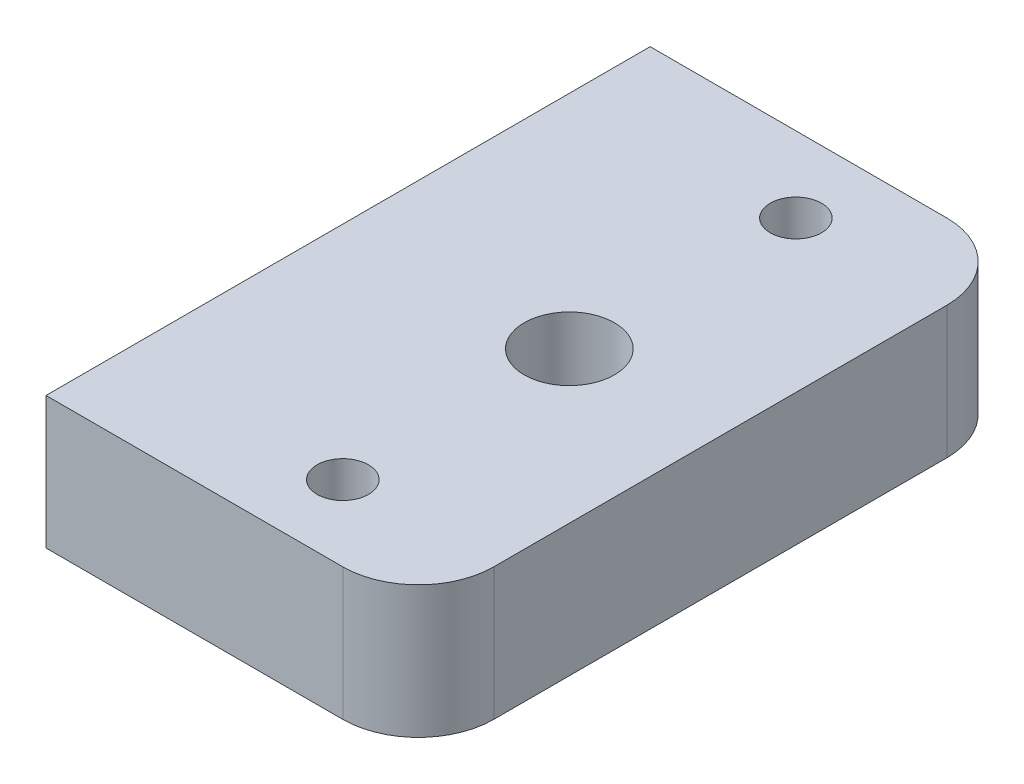
ISO-10303-21;
HEADER;
FILE_DESCRIPTION(('STEP AP214'),'2;1');
FILE_NAME('part.step','',(''),(''),'','','');
FILE_SCHEMA(('AUTOMOTIVE_DESIGN { 1 0 10303 214 1 1 1 1 }'));
ENDSEC;
DATA;
#1=APPLICATION_CONTEXT('core data for automotive mechanical design processes');
#2=APPLICATION_PROTOCOL_DEFINITION('international standard','automotive_design',2000,#1);
#3=PRODUCT_CONTEXT('',#1,'mechanical');
#4=PRODUCT('Part','Part','',(#3));
#5=PRODUCT_RELATED_PRODUCT_CATEGORY('part','',(#4));
#6=PRODUCT_DEFINITION_FORMATION('','',#4);
#7=PRODUCT_DEFINITION_CONTEXT('part definition',#1,'design');
#8=PRODUCT_DEFINITION('design','',#6,#7);
#9=PRODUCT_DEFINITION_SHAPE('','',#8);
#10=(LENGTH_UNIT() NAMED_UNIT(*) SI_UNIT(.MILLI.,.METRE.));
#11=(NAMED_UNIT(*) PLANE_ANGLE_UNIT() SI_UNIT($,.RADIAN.));
#12=(NAMED_UNIT(*) SI_UNIT($,.STERADIAN.) SOLID_ANGLE_UNIT());
#13=UNCERTAINTY_MEASURE_WITH_UNIT(LENGTH_MEASURE(1.E-05),#10,'distance_accuracy_value','');
#14=(GEOMETRIC_REPRESENTATION_CONTEXT(3) GLOBAL_UNCERTAINTY_ASSIGNED_CONTEXT((#13)) GLOBAL_UNIT_ASSIGNED_CONTEXT((#10,
#11,#12)) REPRESENTATION_CONTEXT('',''));
#15=CARTESIAN_POINT('',(0.,0.,0.));
#16=DIRECTION('',(0.,0.,1.));
#17=DIRECTION('',(1.,0.,0.));
#18=AXIS2_PLACEMENT_3D('',#15,#16,#17);
#19=CARTESIAN_POINT('',(-9.30275,5.55625,-12.7));
#20=DIRECTION('',(0.,1.,0.));
#21=DIRECTION('',(0.,0.,1.));
#22=AXIS2_PLACEMENT_3D('',#19,#20,#21);
#23=PLANE('',#22);
#24=CARTESIAN_POINT('',(0.,5.55625,-9.525));
#25=DIRECTION('',(0.,1.,0.));
#26=DIRECTION('',(0.,0.,1.));
#27=AXIS2_PLACEMENT_3D('',#24,#25,#26);
#28=CIRCLE('',#27,1.0795);
#29=CARTESIAN_POINT('',(0.,5.55625,-8.4455));
#30=VERTEX_POINT('',#29);
#31=EDGE_CURVE('E547',#30,#30,#28,.T.);
#32=ORIENTED_EDGE('',*,*,#31,.F.);
#33=EDGE_LOOP('',(#32));
#34=FACE_BOUND('',#33,.T.);
#35=DIRECTION('',(1.,0.,0.));
#36=VECTOR('',#35,1.);
#37=CARTESIAN_POINT('',(6.35,5.55625,12.7));
#38=LINE('',#37,#36);
#39=CARTESIAN_POINT('',(-9.30275,5.55625,12.7));
#40=VERTEX_POINT('',#39);
#41=CARTESIAN_POINT('',(3.175,5.55625,12.7));
#42=VERTEX_POINT('',#41);
#43=EDGE_CURVE('E456',#40,#42,#38,.T.);
#44=ORIENTED_EDGE('',*,*,#43,.T.);
#45=CARTESIAN_POINT('',(3.175,5.55625,9.525));
#46=DIRECTION('',(0.,1.,0.));
#47=DIRECTION('',(0.,0.,1.));
#48=AXIS2_PLACEMENT_3D('',#45,#46,#47);
#49=CIRCLE('',#48,3.175);
#50=CARTESIAN_POINT('',(6.35,5.55625,9.525));
#51=VERTEX_POINT('',#50);
#52=EDGE_CURVE('E368',#42,#51,#49,.T.);
#53=ORIENTED_EDGE('',*,*,#52,.T.);
#54=DIRECTION('',(0.,0.,-1.));
#55=VECTOR('',#54,1.);
#56=CARTESIAN_POINT('',(6.35,5.55625,-12.7));
#57=LINE('',#56,#55);
#58=CARTESIAN_POINT('',(6.35,5.55625,-9.525));
#59=VERTEX_POINT('',#58);
#60=EDGE_CURVE('E442',#51,#59,#57,.T.);
#61=ORIENTED_EDGE('',*,*,#60,.T.);
#62=CARTESIAN_POINT('',(3.175,5.55625,-9.525));
#63=DIRECTION('',(0.,1.,0.));
#64=DIRECTION('',(0.,0.,1.));
#65=AXIS2_PLACEMENT_3D('',#62,#63,#64);
#66=CIRCLE('',#65,3.175);
#67=CARTESIAN_POINT('',(3.175,5.55625,-12.7));
#68=VERTEX_POINT('',#67);
#69=EDGE_CURVE('E375',#59,#68,#66,.T.);
#70=ORIENTED_EDGE('',*,*,#69,.T.);
#71=DIRECTION('',(-1.,0.,0.));
#72=VECTOR('',#71,1.);
#73=CARTESIAN_POINT('',(6.35,5.55625,-12.7));
#74=LINE('',#73,#72);
#75=CARTESIAN_POINT('',(-9.30275,5.55625,-12.7));
#76=VERTEX_POINT('',#75);
#77=EDGE_CURVE('E467',#68,#76,#74,.T.);
#78=ORIENTED_EDGE('',*,*,#77,.T.);
#79=DIRECTION('',(0.,0.,1.));
#80=VECTOR('',#79,1.);
#81=CARTESIAN_POINT('',(-9.30275,5.55625,-12.7));
#82=LINE('',#81,#80);
#83=EDGE_CURVE('E436',#76,#40,#82,.T.);
#84=ORIENTED_EDGE('',*,*,#83,.T.);
#85=EDGE_LOOP('',(#44,#53,#61,#70,#78,#84));
#86=FACE_BOUND('',#85,.T.);
#87=CARTESIAN_POINT('',(0.,5.55625,0.));
#88=DIRECTION('',(0.,1.,0.));
#89=DIRECTION('',(0.,0.,1.));
#90=AXIS2_PLACEMENT_3D('',#87,#88,#89);
#91=CIRCLE('',#90,1.89865);
#92=CARTESIAN_POINT('',(0.,5.55625,1.89865));
#93=VERTEX_POINT('',#92);
#94=EDGE_CURVE('E423',#93,#93,#91,.T.);
#95=ORIENTED_EDGE('',*,*,#94,.F.);
#96=EDGE_LOOP('',(#95));
#97=FACE_BOUND('',#96,.T.);
#98=CARTESIAN_POINT('',(0.,5.55625,9.525));
#99=DIRECTION('',(0.,1.,0.));
#100=DIRECTION('',(0.,0.,1.));
#101=AXIS2_PLACEMENT_3D('',#98,#99,#100);
#102=CIRCLE('',#101,1.0795);
#103=CARTESIAN_POINT('',(0.,5.55625,10.6045));
#104=VERTEX_POINT('',#103);
#105=EDGE_CURVE('E556',#104,#104,#102,.T.);
#106=ORIENTED_EDGE('',*,*,#105,.F.);
#107=EDGE_LOOP('',(#106));
#108=FACE_BOUND('',#107,.T.);
#109=ADVANCED_FACE('F360',(#34,#86,#97,#108),#23,.T.);
#110=CARTESIAN_POINT('',(-9.30275,0.,-12.7));
#111=DIRECTION('',(0.,1.,0.));
#112=DIRECTION('',(0.,0.,1.));
#113=AXIS2_PLACEMENT_3D('',#110,#111,#112);
#114=PLANE('',#113);
#115=CARTESIAN_POINT('',(0.,0.,-9.525));
#116=DIRECTION('',(0.,1.,0.));
#117=DIRECTION('',(0.,0.,1.));
#118=AXIS2_PLACEMENT_3D('',#115,#116,#117);
#119=CIRCLE('',#118,1.0795);
#120=CARTESIAN_POINT('',(0.,0.,-8.4455));
#121=VERTEX_POINT('',#120);
#122=EDGE_CURVE('E551',#121,#121,#119,.T.);
#123=ORIENTED_EDGE('',*,*,#122,.T.);
#124=EDGE_LOOP('',(#123));
#125=FACE_BOUND('',#124,.T.);
#126=DIRECTION('',(0.,0.,-1.));
#127=VECTOR('',#126,1.);
#128=CARTESIAN_POINT('',(6.35,0.,-12.7));
#129=LINE('',#128,#127);
#130=CARTESIAN_POINT('',(6.35,0.,9.525));
#131=VERTEX_POINT('',#130);
#132=CARTESIAN_POINT('',(6.35,0.,-9.525));
#133=VERTEX_POINT('',#132);
#134=EDGE_CURVE('E464',#131,#133,#129,.T.);
#135=ORIENTED_EDGE('',*,*,#134,.F.);
#136=CARTESIAN_POINT('',(3.175,0.,9.525));
#137=DIRECTION('',(0.,1.,0.));
#138=DIRECTION('',(0.,0.,1.));
#139=AXIS2_PLACEMENT_3D('',#136,#137,#138);
#140=CIRCLE('',#139,3.175);
#141=CARTESIAN_POINT('',(3.175,0.,12.7));
#142=VERTEX_POINT('',#141);
#143=EDGE_CURVE('E450',#131,#142,#140,.F.);
#144=ORIENTED_EDGE('',*,*,#143,.T.);
#145=DIRECTION('',(1.,0.,0.));
#146=VECTOR('',#145,1.);
#147=CARTESIAN_POINT('',(6.35,0.,12.7));
#148=LINE('',#147,#146);
#149=CARTESIAN_POINT('',(-9.30275,0.,12.7));
#150=VERTEX_POINT('',#149);
#151=EDGE_CURVE('E429',#150,#142,#148,.T.);
#152=ORIENTED_EDGE('',*,*,#151,.F.);
#153=DIRECTION('',(0.,0.,1.));
#154=VECTOR('',#153,1.);
#155=CARTESIAN_POINT('',(-9.30275,0.,-12.7));
#156=LINE('',#155,#154);
#157=CARTESIAN_POINT('',(-9.30275,0.,-12.7));
#158=VERTEX_POINT('',#157);
#159=EDGE_CURVE('E422',#158,#150,#156,.T.);
#160=ORIENTED_EDGE('',*,*,#159,.F.);
#161=DIRECTION('',(-1.,0.,0.));
#162=VECTOR('',#161,1.);
#163=CARTESIAN_POINT('',(6.35,0.,-12.7));
#164=LINE('',#163,#162);
#165=CARTESIAN_POINT('',(3.175,0.,-12.7));
#166=VERTEX_POINT('',#165);
#167=EDGE_CURVE('E416',#166,#158,#164,.T.);
#168=ORIENTED_EDGE('',*,*,#167,.F.);
#169=CARTESIAN_POINT('',(3.175,0.,-9.525));
#170=DIRECTION('',(0.,1.,0.));
#171=DIRECTION('',(0.,0.,1.));
#172=AXIS2_PLACEMENT_3D('',#169,#170,#171);
#173=CIRCLE('',#172,3.175);
#174=EDGE_CURVE('E448',#166,#133,#173,.F.);
#175=ORIENTED_EDGE('',*,*,#174,.T.);
#176=EDGE_LOOP('',(#135,#144,#152,#160,#168,#175));
#177=FACE_BOUND('',#176,.T.);
#178=CARTESIAN_POINT('',(0.,0.,0.));
#179=DIRECTION('',(0.,1.,0.));
#180=DIRECTION('',(0.,0.,1.));
#181=AXIS2_PLACEMENT_3D('',#178,#179,#180);
#182=CIRCLE('',#181,1.89865);
#183=CARTESIAN_POINT('',(0.,0.,1.89865));
#184=VERTEX_POINT('',#183);
#185=EDGE_CURVE('E546',#184,#184,#182,.T.);
#186=ORIENTED_EDGE('',*,*,#185,.T.);
#187=EDGE_LOOP('',(#186));
#188=FACE_BOUND('',#187,.T.);
#189=CARTESIAN_POINT('',(0.,0.,9.525));
#190=DIRECTION('',(0.,1.,0.));
#191=DIRECTION('',(0.,0.,1.));
#192=AXIS2_PLACEMENT_3D('',#189,#190,#191);
#193=CIRCLE('',#192,1.0795);
#194=CARTESIAN_POINT('',(0.,0.,10.6045));
#195=VERTEX_POINT('',#194);
#196=EDGE_CURVE('E559',#195,#195,#193,.T.);
#197=ORIENTED_EDGE('',*,*,#196,.T.);
#198=EDGE_LOOP('',(#197));
#199=FACE_BOUND('',#198,.T.);
#200=ADVANCED_FACE('F427',(#125,#177,#188,#199),#114,.F.);
#201=CARTESIAN_POINT('',(6.35,5.55625,-12.7));
#202=DIRECTION('',(0.,0.,1.));
#203=DIRECTION('',(1.,0.,0.));
#204=AXIS2_PLACEMENT_3D('',#201,#202,#203);
#205=PLANE('',#204);
#206=ORIENTED_EDGE('',*,*,#77,.F.);
#207=DIRECTION('',(0.,-1.,0.));
#208=VECTOR('',#207,1.);
#209=CARTESIAN_POINT('',(3.175,5.55625,-12.7));
#210=LINE('',#209,#208);
#211=EDGE_CURVE('E11',#68,#166,#210,.T.);
#212=ORIENTED_EDGE('',*,*,#211,.T.);
#213=ORIENTED_EDGE('',*,*,#167,.T.);
#214=DIRECTION('',(0.,-1.,0.));
#215=VECTOR('',#214,1.);
#216=CARTESIAN_POINT('',(-9.30275,5.55625,-12.7));
#217=LINE('',#216,#215);
#218=EDGE_CURVE('E419',#76,#158,#217,.T.);
#219=ORIENTED_EDGE('',*,*,#218,.F.);
#220=EDGE_LOOP('',(#206,#212,#213,#219));
#221=FACE_BOUND('',#220,.T.);
#222=ADVANCED_FACE('F362',(#221),#205,.F.);
#223=CARTESIAN_POINT('',(-9.30275,5.55625,-12.7));
#224=DIRECTION('',(1.,0.,0.));
#225=DIRECTION('',(0.,0.,-1.));
#226=AXIS2_PLACEMENT_3D('',#223,#224,#225);
#227=PLANE('',#226);
#228=ORIENTED_EDGE('',*,*,#159,.T.);
#229=DIRECTION('',(0.,-1.,0.));
#230=VECTOR('',#229,1.);
#231=CARTESIAN_POINT('',(-9.30275,5.55625,12.7));
#232=LINE('',#231,#230);
#233=EDGE_CURVE('E438',#40,#150,#232,.T.);
#234=ORIENTED_EDGE('',*,*,#233,.F.);
#235=ORIENTED_EDGE('',*,*,#83,.F.);
#236=ORIENTED_EDGE('',*,*,#218,.T.);
#237=EDGE_LOOP('',(#228,#234,#235,#236));
#238=FACE_BOUND('',#237,.T.);
#239=ADVANCED_FACE('F435',(#238),#227,.F.);
#240=CARTESIAN_POINT('',(6.35,5.55625,12.7));
#241=DIRECTION('',(0.,0.,-1.));
#242=DIRECTION('',(-1.,0.,0.));
#243=AXIS2_PLACEMENT_3D('',#240,#241,#242);
#244=PLANE('',#243);
#245=ORIENTED_EDGE('',*,*,#151,.T.);
#246=DIRECTION('',(0.,-1.,0.));
#247=VECTOR('',#246,1.);
#248=CARTESIAN_POINT('',(3.175,5.55625,12.7));
#249=LINE('',#248,#247);
#250=EDGE_CURVE('E383',#142,#42,#249,.F.);
#251=ORIENTED_EDGE('',*,*,#250,.T.);
#252=ORIENTED_EDGE('',*,*,#43,.F.);
#253=ORIENTED_EDGE('',*,*,#233,.T.);
#254=EDGE_LOOP('',(#245,#251,#252,#253));
#255=FACE_BOUND('',#254,.T.);
#256=ADVANCED_FACE('F465',(#255),#244,.F.);
#257=CARTESIAN_POINT('',(6.35,5.55625,-12.7));
#258=DIRECTION('',(-1.,0.,0.));
#259=DIRECTION('',(0.,0.,1.));
#260=AXIS2_PLACEMENT_3D('',#257,#258,#259);
#261=PLANE('',#260);
#262=ORIENTED_EDGE('',*,*,#60,.F.);
#263=DIRECTION('',(0.,-1.,0.));
#264=VECTOR('',#263,1.);
#265=CARTESIAN_POINT('',(6.35,5.55625,9.525));
#266=LINE('',#265,#264);
#267=EDGE_CURVE('E440',#51,#131,#266,.T.);
#268=ORIENTED_EDGE('',*,*,#267,.T.);
#269=ORIENTED_EDGE('',*,*,#134,.T.);
#270=DIRECTION('',(0.,-1.,0.));
#271=VECTOR('',#270,1.);
#272=CARTESIAN_POINT('',(6.35,5.55625,-9.525));
#273=LINE('',#272,#271);
#274=EDGE_CURVE('E437',#133,#59,#273,.F.);
#275=ORIENTED_EDGE('',*,*,#274,.T.);
#276=EDGE_LOOP('',(#262,#268,#269,#275));
#277=FACE_BOUND('',#276,.T.);
#278=ADVANCED_FACE('F460',(#277),#261,.F.);
#279=CARTESIAN_POINT('',(0.,5.55625,0.));
#280=DIRECTION('',(0.,-1.,0.));
#281=DIRECTION('',(0.,0.,-1.));
#282=AXIS2_PLACEMENT_3D('',#279,#280,#281);
#283=CYLINDRICAL_SURFACE('',#282,1.89865);
#284=ORIENTED_EDGE('',*,*,#94,.T.);
#285=EDGE_LOOP('',(#284));
#286=FACE_BOUND('',#285,.T.);
#287=ORIENTED_EDGE('',*,*,#185,.F.);
#288=EDGE_LOOP('',(#287));
#289=FACE_BOUND('',#288,.T.);
#290=ADVANCED_FACE('F495',(#286,#289),#283,.F.);
#291=CARTESIAN_POINT('',(0.,5.55625,-9.525));
#292=DIRECTION('',(0.,-1.,0.));
#293=DIRECTION('',(0.,0.,-1.));
#294=AXIS2_PLACEMENT_3D('',#291,#292,#293);
#295=CYLINDRICAL_SURFACE('',#294,1.0795);
#296=ORIENTED_EDGE('',*,*,#31,.T.);
#297=EDGE_LOOP('',(#296));
#298=FACE_BOUND('',#297,.T.);
#299=ORIENTED_EDGE('',*,*,#122,.F.);
#300=EDGE_LOOP('',(#299));
#301=FACE_BOUND('',#300,.T.);
#302=ADVANCED_FACE('F527',(#298,#301),#295,.F.);
#303=CARTESIAN_POINT('',(0.,5.55625,9.525));
#304=DIRECTION('',(0.,-1.,0.));
#305=DIRECTION('',(0.,0.,-1.));
#306=AXIS2_PLACEMENT_3D('',#303,#304,#305);
#307=CYLINDRICAL_SURFACE('',#306,1.0795);
#308=ORIENTED_EDGE('',*,*,#105,.T.);
#309=EDGE_LOOP('',(#308));
#310=FACE_BOUND('',#309,.T.);
#311=ORIENTED_EDGE('',*,*,#196,.F.);
#312=EDGE_LOOP('',(#311));
#313=FACE_BOUND('',#312,.T.);
#314=ADVANCED_FACE('F479',(#310,#313),#307,.F.);
#315=CARTESIAN_POINT('',(3.175,5.55625,9.525));
#316=DIRECTION('',(0.,-1.,0.));
#317=DIRECTION('',(0.,0.,-1.));
#318=AXIS2_PLACEMENT_3D('',#315,#316,#317);
#319=CYLINDRICAL_SURFACE('',#318,3.175);
#320=ORIENTED_EDGE('',*,*,#52,.F.);
#321=ORIENTED_EDGE('',*,*,#250,.F.);
#322=ORIENTED_EDGE('',*,*,#143,.F.);
#323=ORIENTED_EDGE('',*,*,#267,.F.);
#324=EDGE_LOOP('',(#320,#321,#322,#323));
#325=FACE_BOUND('',#324,.T.);
#326=ADVANCED_FACE('F463',(#325),#319,.T.);
#327=CARTESIAN_POINT('',(3.175,5.55625,-9.525));
#328=DIRECTION('',(0.,-1.,0.));
#329=DIRECTION('',(0.,0.,-1.));
#330=AXIS2_PLACEMENT_3D('',#327,#328,#329);
#331=CYLINDRICAL_SURFACE('',#330,3.175);
#332=ORIENTED_EDGE('',*,*,#69,.F.);
#333=ORIENTED_EDGE('',*,*,#274,.F.);
#334=ORIENTED_EDGE('',*,*,#174,.F.);
#335=ORIENTED_EDGE('',*,*,#211,.F.);
#336=EDGE_LOOP('',(#332,#333,#334,#335));
#337=FACE_BOUND('',#336,.T.);
#338=ADVANCED_FACE('F473',(#337),#331,.T.);
#339=CLOSED_SHELL('',(#109,#200,#222,#239,#256,#278,#290,#302,#314,#326,#338));
#340=MANIFOLD_SOLID_BREP('B2',#339);
#341=ADVANCED_BREP_SHAPE_REPRESENTATION('',(#18,#340),#14);
#342=SHAPE_DEFINITION_REPRESENTATION(#9,#341);
ENDSEC;
END-ISO-10303-21;
